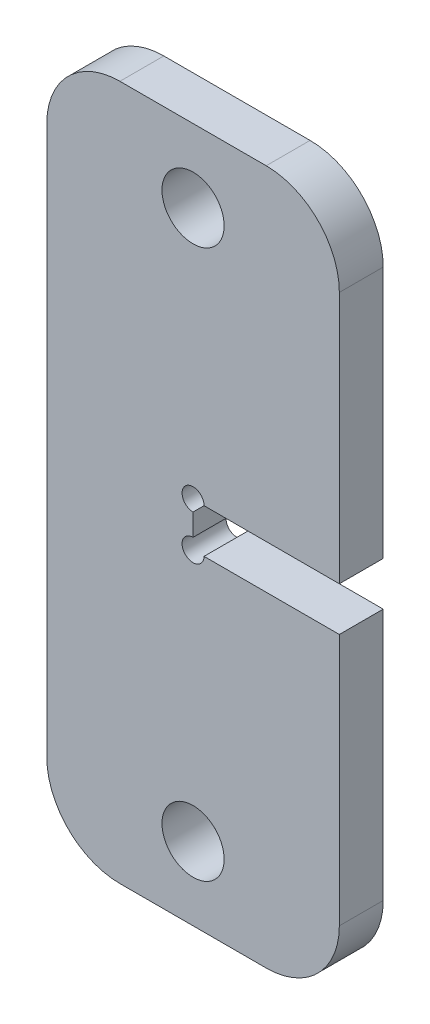
ISO-10303-21;
HEADER;
FILE_DESCRIPTION(('STEP AP214'),'2;1');
FILE_NAME('part.step','',(''),(''),'','','');
FILE_SCHEMA(('AUTOMOTIVE_DESIGN { 1 0 10303 214 1 1 1 1 }'));
ENDSEC;
DATA;
#1=APPLICATION_CONTEXT('core data for automotive mechanical design processes');
#2=APPLICATION_PROTOCOL_DEFINITION('international standard','automotive_design',2000,#1);
#3=PRODUCT_CONTEXT('',#1,'mechanical');
#4=PRODUCT('Part','Part','',(#3));
#5=PRODUCT_RELATED_PRODUCT_CATEGORY('part','',(#4));
#6=PRODUCT_DEFINITION_FORMATION('','',#4);
#7=PRODUCT_DEFINITION_CONTEXT('part definition',#1,'design');
#8=PRODUCT_DEFINITION('design','',#6,#7);
#9=PRODUCT_DEFINITION_SHAPE('','',#8);
#10=(LENGTH_UNIT() NAMED_UNIT(*) SI_UNIT(.MILLI.,.METRE.));
#11=(NAMED_UNIT(*) PLANE_ANGLE_UNIT() SI_UNIT($,.RADIAN.));
#12=(NAMED_UNIT(*) SI_UNIT($,.STERADIAN.) SOLID_ANGLE_UNIT());
#13=UNCERTAINTY_MEASURE_WITH_UNIT(LENGTH_MEASURE(1.E-05),#10,'distance_accuracy_value','');
#14=(GEOMETRIC_REPRESENTATION_CONTEXT(3) GLOBAL_UNCERTAINTY_ASSIGNED_CONTEXT((#13)) GLOBAL_UNIT_ASSIGNED_CONTEXT((#10,
#11,#12)) REPRESENTATION_CONTEXT('',''));
#15=CARTESIAN_POINT('',(0.,0.,0.));
#16=DIRECTION('',(0.,0.,1.));
#17=DIRECTION('',(1.,0.,0.));
#18=AXIS2_PLACEMENT_3D('',#15,#16,#17);
#19=CARTESIAN_POINT('',(681.,310.,6.00000000000001));
#20=DIRECTION('',(0.,0.,1.));
#21=DIRECTION('',(1.,0.,0.));
#22=AXIS2_PLACEMENT_3D('',#19,#20,#21);
#23=PLANE('',#22);
#24=CARTESIAN_POINT('',(691.,385.,6.00000000000001));
#25=DIRECTION('',(0.,0.,-1.));
#26=DIRECTION('',(-1.,0.,0.));
#27=AXIS2_PLACEMENT_3D('',#24,#25,#26);
#28=CIRCLE('',#27,4.24999999999998);
#29=CARTESIAN_POINT('',(686.75,385.,6.00000000000001));
#30=VERTEX_POINT('',#29);
#31=EDGE_CURVE('E195',#30,#30,#28,.T.);
#32=ORIENTED_EDGE('',*,*,#31,.T.);
#33=EDGE_LOOP('',(#32));
#34=FACE_BOUND('',#33,.T.);
#35=CARTESIAN_POINT('',(691.,310.,6.00000000000001));
#36=DIRECTION('',(0.,0.,-1.));
#37=DIRECTION('',(-1.,0.,0.));
#38=AXIS2_PLACEMENT_3D('',#35,#36,#37);
#39=CIRCLE('',#38,4.24999999999998);
#40=CARTESIAN_POINT('',(686.75,310.,6.00000000000001));
#41=VERTEX_POINT('',#40);
#42=EDGE_CURVE('E136',#41,#41,#39,.T.);
#43=ORIENTED_EDGE('',*,*,#42,.T.);
#44=EDGE_LOOP('',(#43));
#45=FACE_BOUND('',#44,.T.);
#46=CARTESIAN_POINT('',(691.,344.5,6.00000000000001));
#47=DIRECTION('',(0.,0.,1.));
#48=DIRECTION('',(1.,0.,0.));
#49=AXIS2_PLACEMENT_3D('',#46,#47,#48);
#50=CIRCLE('',#49,1.49999999999995);
#51=CARTESIAN_POINT('',(692.5,344.5,6.00000000000001));
#52=VERTEX_POINT('',#51);
#53=CARTESIAN_POINT('',(691.,346.,6.00000000000001));
#54=VERTEX_POINT('',#53);
#55=EDGE_CURVE('E203',#52,#54,#50,.F.);
#56=ORIENTED_EDGE('',*,*,#55,.T.);
#57=DIRECTION('',(0.,1.,0.));
#58=VECTOR('',#57,1.);
#59=CARTESIAN_POINT('',(691.,350.5,6.00000000000001));
#60=LINE('',#59,#58);
#61=CARTESIAN_POINT('',(691.,349.,6.00000000000001));
#62=VERTEX_POINT('',#61);
#63=EDGE_CURVE('E141',#54,#62,#60,.T.);
#64=ORIENTED_EDGE('',*,*,#63,.T.);
#65=CARTESIAN_POINT('',(691.,350.5,6.00000000000001));
#66=DIRECTION('',(0.,0.,1.));
#67=DIRECTION('',(1.,0.,0.));
#68=AXIS2_PLACEMENT_3D('',#65,#66,#67);
#69=CIRCLE('',#68,1.49999999999995);
#70=CARTESIAN_POINT('',(692.5,350.5,6.00000000000001));
#71=VERTEX_POINT('',#70);
#72=EDGE_CURVE('E200',#62,#71,#69,.F.);
#73=ORIENTED_EDGE('',*,*,#72,.T.);
#74=DIRECTION('',(1.,0.,0.));
#75=VECTOR('',#74,1.);
#76=CARTESIAN_POINT('',(691.,350.5,6.00000000000001));
#77=LINE('',#76,#75);
#78=CARTESIAN_POINT('',(711.,350.5,6.00000000000001));
#79=VERTEX_POINT('',#78);
#80=EDGE_CURVE('E121',#71,#79,#77,.T.);
#81=ORIENTED_EDGE('',*,*,#80,.T.);
#82=DIRECTION('',(0.,1.,0.));
#83=VECTOR('',#82,1.);
#84=CARTESIAN_POINT('',(711.,350.5,6.00000000000001));
#85=LINE('',#84,#83);
#86=CARTESIAN_POINT('',(711.,385.,6.00000000000001));
#87=VERTEX_POINT('',#86);
#88=EDGE_CURVE('E118',#79,#87,#85,.T.);
#89=ORIENTED_EDGE('',*,*,#88,.T.);
#90=CARTESIAN_POINT('',(701.,385.,6.00000000000001));
#91=DIRECTION('',(0.,0.,-1.));
#92=DIRECTION('',(-1.,0.,0.));
#93=AXIS2_PLACEMENT_3D('',#90,#91,#92);
#94=CIRCLE('',#93,10.);
#95=CARTESIAN_POINT('',(701.,395.,6.00000000000001));
#96=VERTEX_POINT('',#95);
#97=EDGE_CURVE('E19',#96,#87,#94,.T.);
#98=ORIENTED_EDGE('',*,*,#97,.F.);
#99=DIRECTION('',(1.,0.,0.));
#100=VECTOR('',#99,1.);
#101=CARTESIAN_POINT('',(701.,395.,6.00000000000001));
#102=LINE('',#101,#100);
#103=CARTESIAN_POINT('',(681.,395.,6.00000000000001));
#104=VERTEX_POINT('',#103);
#105=EDGE_CURVE('E131',#96,#104,#102,.F.);
#106=ORIENTED_EDGE('',*,*,#105,.T.);
#107=CARTESIAN_POINT('',(681.,385.,6.00000000000001));
#108=DIRECTION('',(0.,0.,-1.));
#109=DIRECTION('',(-1.,0.,0.));
#110=AXIS2_PLACEMENT_3D('',#107,#108,#109);
#111=CIRCLE('',#110,10.);
#112=CARTESIAN_POINT('',(671.,385.,6.00000000000001));
#113=VERTEX_POINT('',#112);
#114=EDGE_CURVE('E167',#113,#104,#111,.T.);
#115=ORIENTED_EDGE('',*,*,#114,.F.);
#116=DIRECTION('',(0.,1.,0.));
#117=VECTOR('',#116,1.);
#118=CARTESIAN_POINT('',(671.,385.,6.00000000000001));
#119=LINE('',#118,#117);
#120=CARTESIAN_POINT('',(671.,310.,6.00000000000001));
#121=VERTEX_POINT('',#120);
#122=EDGE_CURVE('E162',#113,#121,#119,.F.);
#123=ORIENTED_EDGE('',*,*,#122,.T.);
#124=CARTESIAN_POINT('',(681.,310.,6.00000000000001));
#125=DIRECTION('',(0.,0.,-1.));
#126=DIRECTION('',(-1.,0.,0.));
#127=AXIS2_PLACEMENT_3D('',#124,#125,#126);
#128=CIRCLE('',#127,10.);
#129=CARTESIAN_POINT('',(681.,300.,6.00000000000001));
#130=VERTEX_POINT('',#129);
#131=EDGE_CURVE('E165',#130,#121,#128,.T.);
#132=ORIENTED_EDGE('',*,*,#131,.F.);
#133=DIRECTION('',(1.,0.,0.));
#134=VECTOR('',#133,1.);
#135=CARTESIAN_POINT('',(681.,300.,6.00000000000001));
#136=LINE('',#135,#134);
#137=CARTESIAN_POINT('',(701.,300.,6.00000000000001));
#138=VERTEX_POINT('',#137);
#139=EDGE_CURVE('E157',#130,#138,#136,.T.);
#140=ORIENTED_EDGE('',*,*,#139,.T.);
#141=CARTESIAN_POINT('',(701.,310.,6.00000000000001));
#142=DIRECTION('',(0.,0.,-1.));
#143=DIRECTION('',(-1.,0.,0.));
#144=AXIS2_PLACEMENT_3D('',#141,#142,#143);
#145=CIRCLE('',#144,10.);
#146=CARTESIAN_POINT('',(711.,310.,6.00000000000001));
#147=VERTEX_POINT('',#146);
#148=EDGE_CURVE('E160',#147,#138,#145,.T.);
#149=ORIENTED_EDGE('',*,*,#148,.F.);
#150=DIRECTION('',(0.,1.,0.));
#151=VECTOR('',#150,1.);
#152=CARTESIAN_POINT('',(711.,310.,6.00000000000001));
#153=LINE('',#152,#151);
#154=CARTESIAN_POINT('',(711.,344.5,6.00000000000001));
#155=VERTEX_POINT('',#154);
#156=EDGE_CURVE('E151',#147,#155,#153,.T.);
#157=ORIENTED_EDGE('',*,*,#156,.T.);
#158=DIRECTION('',(1.,0.,0.));
#159=VECTOR('',#158,1.);
#160=CARTESIAN_POINT('',(691.,344.5,6.00000000000001));
#161=LINE('',#160,#159);
#162=EDGE_CURVE('E145',#155,#52,#161,.F.);
#163=ORIENTED_EDGE('',*,*,#162,.T.);
#164=EDGE_LOOP('',(#56,#64,#73,#81,#89,#98,#106,#115,#123,#132,#140,#149,#157,#163));
#165=FACE_BOUND('',#164,.T.);
#166=ADVANCED_FACE('F16',(#34,#45,#165),#23,.T.);
#167=CARTESIAN_POINT('',(711.,350.5,6.00000000000001));
#168=DIRECTION('',(-1.,0.,0.));
#169=DIRECTION('',(0.,0.,1.));
#170=AXIS2_PLACEMENT_3D('',#167,#168,#169);
#171=PLANE('',#170);
#172=DIRECTION('',(0.,0.,-1.));
#173=VECTOR('',#172,1.);
#174=CARTESIAN_POINT('',(711.,385.,6.00000000000001));
#175=LINE('',#174,#173);
#176=CARTESIAN_POINT('',(711.,385.,0.));
#177=VERTEX_POINT('',#176);
#178=EDGE_CURVE('E115',#87,#177,#175,.T.);
#179=ORIENTED_EDGE('',*,*,#178,.F.);
#180=ORIENTED_EDGE('',*,*,#88,.F.);
#181=DIRECTION('',(0.,0.,1.));
#182=VECTOR('',#181,1.);
#183=CARTESIAN_POINT('',(711.,350.5,6.00000000000001));
#184=LINE('',#183,#182);
#185=CARTESIAN_POINT('',(711.,350.5,0.));
#186=VERTEX_POINT('',#185);
#187=EDGE_CURVE('E202',#79,#186,#184,.F.);
#188=ORIENTED_EDGE('',*,*,#187,.T.);
#189=DIRECTION('',(0.,1.,0.));
#190=VECTOR('',#189,1.);
#191=CARTESIAN_POINT('',(711.,310.,0.));
#192=LINE('',#191,#190);
#193=EDGE_CURVE('E129',#186,#177,#192,.T.);
#194=ORIENTED_EDGE('',*,*,#193,.T.);
#195=EDGE_LOOP('',(#179,#180,#188,#194));
#196=FACE_BOUND('',#195,.T.);
#197=ADVANCED_FACE('F127',(#196),#171,.F.);
#198=CARTESIAN_POINT('',(701.,385.,6.00000000000001));
#199=DIRECTION('',(0.,0.,-1.));
#200=DIRECTION('',(-1.,0.,0.));
#201=AXIS2_PLACEMENT_3D('',#198,#199,#200);
#202=CYLINDRICAL_SURFACE('',#201,10.);
#203=ORIENTED_EDGE('',*,*,#97,.T.);
#204=ORIENTED_EDGE('',*,*,#178,.T.);
#205=CARTESIAN_POINT('',(701.,385.,0.));
#206=DIRECTION('',(0.,0.,-1.));
#207=DIRECTION('',(-1.,0.,0.));
#208=AXIS2_PLACEMENT_3D('',#205,#206,#207);
#209=CIRCLE('',#208,10.);
#210=CARTESIAN_POINT('',(701.,395.,0.));
#211=VERTEX_POINT('',#210);
#212=EDGE_CURVE('E193',#177,#211,#209,.F.);
#213=ORIENTED_EDGE('',*,*,#212,.T.);
#214=DIRECTION('',(0.,0.,-1.));
#215=VECTOR('',#214,1.);
#216=CARTESIAN_POINT('',(701.,395.,6.00000000000001));
#217=LINE('',#216,#215);
#218=EDGE_CURVE('E117',#211,#96,#217,.F.);
#219=ORIENTED_EDGE('',*,*,#218,.T.);
#220=EDGE_LOOP('',(#203,#204,#213,#219));
#221=FACE_BOUND('',#220,.T.);
#222=ADVANCED_FACE('F112',(#221),#202,.T.);
#223=CARTESIAN_POINT('',(701.,395.,6.00000000000001));
#224=DIRECTION('',(0.,-1.,0.));
#225=DIRECTION('',(0.,0.,-1.));
#226=AXIS2_PLACEMENT_3D('',#223,#224,#225);
#227=PLANE('',#226);
#228=DIRECTION('',(0.,0.,-1.));
#229=VECTOR('',#228,1.);
#230=CARTESIAN_POINT('',(681.,395.,6.00000000000001));
#231=LINE('',#230,#229);
#232=CARTESIAN_POINT('',(681.,395.,0.));
#233=VERTEX_POINT('',#232);
#234=EDGE_CURVE('E208',#104,#233,#231,.T.);
#235=ORIENTED_EDGE('',*,*,#234,.F.);
#236=ORIENTED_EDGE('',*,*,#105,.F.);
#237=ORIENTED_EDGE('',*,*,#218,.F.);
#238=DIRECTION('',(1.,0.,0.));
#239=VECTOR('',#238,1.);
#240=CARTESIAN_POINT('',(681.,395.,0.));
#241=LINE('',#240,#239);
#242=EDGE_CURVE('E192',#211,#233,#241,.F.);
#243=ORIENTED_EDGE('',*,*,#242,.T.);
#244=EDGE_LOOP('',(#235,#236,#237,#243));
#245=FACE_BOUND('',#244,.T.);
#246=ADVANCED_FACE('F301',(#245),#227,.F.);
#247=CARTESIAN_POINT('',(681.,385.,6.00000000000001));
#248=DIRECTION('',(0.,0.,-1.));
#249=DIRECTION('',(-1.,0.,0.));
#250=AXIS2_PLACEMENT_3D('',#247,#248,#249);
#251=CYLINDRICAL_SURFACE('',#250,10.);
#252=ORIENTED_EDGE('',*,*,#114,.T.);
#253=ORIENTED_EDGE('',*,*,#234,.T.);
#254=CARTESIAN_POINT('',(681.,385.,0.));
#255=DIRECTION('',(0.,0.,-1.));
#256=DIRECTION('',(-1.,0.,0.));
#257=AXIS2_PLACEMENT_3D('',#254,#255,#256);
#258=CIRCLE('',#257,10.);
#259=CARTESIAN_POINT('',(671.,385.,0.));
#260=VERTEX_POINT('',#259);
#261=EDGE_CURVE('E189',#233,#260,#258,.F.);
#262=ORIENTED_EDGE('',*,*,#261,.T.);
#263=DIRECTION('',(0.,0.,-1.));
#264=VECTOR('',#263,1.);
#265=CARTESIAN_POINT('',(671.,385.,6.00000000000001));
#266=LINE('',#265,#264);
#267=EDGE_CURVE('E166',#260,#113,#266,.F.);
#268=ORIENTED_EDGE('',*,*,#267,.T.);
#269=EDGE_LOOP('',(#252,#253,#262,#268));
#270=FACE_BOUND('',#269,.T.);
#271=ADVANCED_FACE('F298',(#270),#251,.T.);
#272=CARTESIAN_POINT('',(671.,385.,6.00000000000001));
#273=DIRECTION('',(1.,0.,0.));
#274=DIRECTION('',(0.,0.,-1.));
#275=AXIS2_PLACEMENT_3D('',#272,#273,#274);
#276=PLANE('',#275);
#277=DIRECTION('',(0.,0.,-1.));
#278=VECTOR('',#277,1.);
#279=CARTESIAN_POINT('',(671.,310.,6.00000000000001));
#280=LINE('',#279,#278);
#281=CARTESIAN_POINT('',(671.,310.,0.));
#282=VERTEX_POINT('',#281);
#283=EDGE_CURVE('E207',#121,#282,#280,.T.);
#284=ORIENTED_EDGE('',*,*,#283,.F.);
#285=ORIENTED_EDGE('',*,*,#122,.F.);
#286=ORIENTED_EDGE('',*,*,#267,.F.);
#287=DIRECTION('',(0.,1.,0.));
#288=VECTOR('',#287,1.);
#289=CARTESIAN_POINT('',(671.,310.,0.));
#290=LINE('',#289,#288);
#291=EDGE_CURVE('E188',#260,#282,#290,.F.);
#292=ORIENTED_EDGE('',*,*,#291,.T.);
#293=EDGE_LOOP('',(#284,#285,#286,#292));
#294=FACE_BOUND('',#293,.T.);
#295=ADVANCED_FACE('F296',(#294),#276,.F.);
#296=CARTESIAN_POINT('',(681.,310.,6.00000000000001));
#297=DIRECTION('',(0.,0.,-1.));
#298=DIRECTION('',(-1.,0.,0.));
#299=AXIS2_PLACEMENT_3D('',#296,#297,#298);
#300=CYLINDRICAL_SURFACE('',#299,10.);
#301=ORIENTED_EDGE('',*,*,#131,.T.);
#302=ORIENTED_EDGE('',*,*,#283,.T.);
#303=CARTESIAN_POINT('',(681.,310.,0.));
#304=DIRECTION('',(0.,0.,-1.));
#305=DIRECTION('',(-1.,0.,0.));
#306=AXIS2_PLACEMENT_3D('',#303,#304,#305);
#307=CIRCLE('',#306,10.);
#308=CARTESIAN_POINT('',(681.,300.,0.));
#309=VERTEX_POINT('',#308);
#310=EDGE_CURVE('E185',#282,#309,#307,.F.);
#311=ORIENTED_EDGE('',*,*,#310,.T.);
#312=DIRECTION('',(0.,0.,1.));
#313=VECTOR('',#312,1.);
#314=CARTESIAN_POINT('',(681.,300.,6.00000000000001));
#315=LINE('',#314,#313);
#316=EDGE_CURVE('E161',#309,#130,#315,.T.);
#317=ORIENTED_EDGE('',*,*,#316,.T.);
#318=EDGE_LOOP('',(#301,#302,#311,#317));
#319=FACE_BOUND('',#318,.T.);
#320=ADVANCED_FACE('F292',(#319),#300,.T.);
#321=CARTESIAN_POINT('',(681.,300.,6.00000000000001));
#322=DIRECTION('',(0.,1.,0.));
#323=DIRECTION('',(0.,0.,1.));
#324=AXIS2_PLACEMENT_3D('',#321,#322,#323);
#325=PLANE('',#324);
#326=DIRECTION('',(0.,0.,-1.));
#327=VECTOR('',#326,1.);
#328=CARTESIAN_POINT('',(701.,300.,6.00000000000001));
#329=LINE('',#328,#327);
#330=CARTESIAN_POINT('',(701.,300.,0.));
#331=VERTEX_POINT('',#330);
#332=EDGE_CURVE('E206',#138,#331,#329,.T.);
#333=ORIENTED_EDGE('',*,*,#332,.F.);
#334=ORIENTED_EDGE('',*,*,#139,.F.);
#335=ORIENTED_EDGE('',*,*,#316,.F.);
#336=DIRECTION('',(1.,0.,0.));
#337=VECTOR('',#336,1.);
#338=CARTESIAN_POINT('',(681.,300.,0.));
#339=LINE('',#338,#337);
#340=EDGE_CURVE('E184',#309,#331,#339,.T.);
#341=ORIENTED_EDGE('',*,*,#340,.T.);
#342=EDGE_LOOP('',(#333,#334,#335,#341));
#343=FACE_BOUND('',#342,.T.);
#344=ADVANCED_FACE('F289',(#343),#325,.F.);
#345=CARTESIAN_POINT('',(701.,310.,6.00000000000001));
#346=DIRECTION('',(0.,0.,-1.));
#347=DIRECTION('',(-1.,0.,0.));
#348=AXIS2_PLACEMENT_3D('',#345,#346,#347);
#349=CYLINDRICAL_SURFACE('',#348,10.);
#350=ORIENTED_EDGE('',*,*,#148,.T.);
#351=ORIENTED_EDGE('',*,*,#332,.T.);
#352=CARTESIAN_POINT('',(701.,310.,0.));
#353=DIRECTION('',(0.,0.,-1.));
#354=DIRECTION('',(-1.,0.,0.));
#355=AXIS2_PLACEMENT_3D('',#352,#353,#354);
#356=CIRCLE('',#355,10.);
#357=CARTESIAN_POINT('',(711.,310.,0.));
#358=VERTEX_POINT('',#357);
#359=EDGE_CURVE('E180',#331,#358,#356,.F.);
#360=ORIENTED_EDGE('',*,*,#359,.T.);
#361=DIRECTION('',(0.,0.,1.));
#362=VECTOR('',#361,1.);
#363=CARTESIAN_POINT('',(711.,310.,6.00000000000001));
#364=LINE('',#363,#362);
#365=EDGE_CURVE('E154',#358,#147,#364,.T.);
#366=ORIENTED_EDGE('',*,*,#365,.T.);
#367=EDGE_LOOP('',(#350,#351,#360,#366));
#368=FACE_BOUND('',#367,.T.);
#369=ADVANCED_FACE('F284',(#368),#349,.T.);
#370=CARTESIAN_POINT('',(711.,310.,6.00000000000001));
#371=DIRECTION('',(-1.,0.,0.));
#372=DIRECTION('',(0.,0.,1.));
#373=AXIS2_PLACEMENT_3D('',#370,#371,#372);
#374=PLANE('',#373);
#375=DIRECTION('',(0.,0.,-1.));
#376=VECTOR('',#375,1.);
#377=CARTESIAN_POINT('',(711.,344.5,6.00000000000001));
#378=LINE('',#377,#376);
#379=CARTESIAN_POINT('',(711.,344.5,0.));
#380=VERTEX_POINT('',#379);
#381=EDGE_CURVE('E148',#380,#155,#378,.F.);
#382=ORIENTED_EDGE('',*,*,#381,.T.);
#383=ORIENTED_EDGE('',*,*,#156,.F.);
#384=ORIENTED_EDGE('',*,*,#365,.F.);
#385=DIRECTION('',(0.,1.,0.));
#386=VECTOR('',#385,1.);
#387=CARTESIAN_POINT('',(711.,310.,0.));
#388=LINE('',#387,#386);
#389=EDGE_CURVE('E183',#358,#380,#388,.T.);
#390=ORIENTED_EDGE('',*,*,#389,.T.);
#391=EDGE_LOOP('',(#382,#383,#384,#390));
#392=FACE_BOUND('',#391,.T.);
#393=ADVANCED_FACE('F281',(#392),#374,.F.);
#394=CARTESIAN_POINT('',(691.,344.5,6.00000000000001));
#395=DIRECTION('',(0.,-1.,0.));
#396=DIRECTION('',(0.,0.,-1.));
#397=AXIS2_PLACEMENT_3D('',#394,#395,#396);
#398=PLANE('',#397);
#399=DIRECTION('',(0.,0.,1.));
#400=VECTOR('',#399,1.);
#401=CARTESIAN_POINT('',(692.5,344.5,0.));
#402=LINE('',#401,#400);
#403=CARTESIAN_POINT('',(692.5,344.5,0.));
#404=VERTEX_POINT('',#403);
#405=EDGE_CURVE('E147',#404,#52,#402,.T.);
#406=ORIENTED_EDGE('',*,*,#405,.T.);
#407=ORIENTED_EDGE('',*,*,#162,.F.);
#408=ORIENTED_EDGE('',*,*,#381,.F.);
#409=DIRECTION('',(1.,0.,0.));
#410=VECTOR('',#409,1.);
#411=CARTESIAN_POINT('',(681.,344.5,0.));
#412=LINE('',#411,#410);
#413=EDGE_CURVE('E179',#380,#404,#412,.F.);
#414=ORIENTED_EDGE('',*,*,#413,.T.);
#415=EDGE_LOOP('',(#406,#407,#408,#414));
#416=FACE_BOUND('',#415,.T.);
#417=ADVANCED_FACE('F275',(#416),#398,.F.);
#418=CARTESIAN_POINT('',(691.,344.5,0.));
#419=DIRECTION('',(0.,0.,1.));
#420=DIRECTION('',(1.,0.,0.));
#421=AXIS2_PLACEMENT_3D('',#418,#419,#420);
#422=CYLINDRICAL_SURFACE('',#421,1.49999999999995);
#423=DIRECTION('',(0.,0.,1.));
#424=VECTOR('',#423,1.);
#425=CARTESIAN_POINT('',(691.,346.,6.00000000000001));
#426=LINE('',#425,#424);
#427=CARTESIAN_POINT('',(691.,346.,0.));
#428=VERTEX_POINT('',#427);
#429=EDGE_CURVE('E144',#428,#54,#426,.T.);
#430=ORIENTED_EDGE('',*,*,#429,.T.);
#431=ORIENTED_EDGE('',*,*,#55,.F.);
#432=ORIENTED_EDGE('',*,*,#405,.F.);
#433=CARTESIAN_POINT('',(691.,344.5,0.));
#434=DIRECTION('',(0.,0.,1.));
#435=DIRECTION('',(1.,0.,0.));
#436=AXIS2_PLACEMENT_3D('',#433,#434,#435);
#437=CIRCLE('',#436,1.49999999999995);
#438=EDGE_CURVE('E176',#404,#428,#437,.F.);
#439=ORIENTED_EDGE('',*,*,#438,.T.);
#440=EDGE_LOOP('',(#430,#431,#432,#439));
#441=FACE_BOUND('',#440,.T.);
#442=ADVANCED_FACE('F271',(#441),#422,.F.);
#443=CARTESIAN_POINT('',(691.,350.5,6.00000000000001));
#444=DIRECTION('',(-1.,0.,0.));
#445=DIRECTION('',(0.,0.,1.));
#446=AXIS2_PLACEMENT_3D('',#443,#444,#445);
#447=PLANE('',#446);
#448=DIRECTION('',(0.,0.,1.));
#449=VECTOR('',#448,1.);
#450=CARTESIAN_POINT('',(691.,349.,0.));
#451=LINE('',#450,#449);
#452=CARTESIAN_POINT('',(691.,349.,0.));
#453=VERTEX_POINT('',#452);
#454=EDGE_CURVE('E143',#453,#62,#451,.T.);
#455=ORIENTED_EDGE('',*,*,#454,.T.);
#456=ORIENTED_EDGE('',*,*,#63,.F.);
#457=ORIENTED_EDGE('',*,*,#429,.F.);
#458=DIRECTION('',(0.,1.,0.));
#459=VECTOR('',#458,1.);
#460=CARTESIAN_POINT('',(691.,310.,0.));
#461=LINE('',#460,#459);
#462=EDGE_CURVE('E175',#428,#453,#461,.T.);
#463=ORIENTED_EDGE('',*,*,#462,.T.);
#464=EDGE_LOOP('',(#455,#456,#457,#463));
#465=FACE_BOUND('',#464,.T.);
#466=ADVANCED_FACE('F267',(#465),#447,.F.);
#467=CARTESIAN_POINT('',(691.,350.5,0.));
#468=DIRECTION('',(0.,0.,1.));
#469=DIRECTION('',(1.,0.,0.));
#470=AXIS2_PLACEMENT_3D('',#467,#468,#469);
#471=CYLINDRICAL_SURFACE('',#470,1.49999999999995);
#472=DIRECTION('',(0.,0.,1.));
#473=VECTOR('',#472,1.);
#474=CARTESIAN_POINT('',(692.5,350.5,6.00000000000001));
#475=LINE('',#474,#473);
#476=CARTESIAN_POINT('',(692.5,350.5,0.));
#477=VERTEX_POINT('',#476);
#478=EDGE_CURVE('E34',#477,#71,#475,.T.);
#479=ORIENTED_EDGE('',*,*,#478,.T.);
#480=ORIENTED_EDGE('',*,*,#72,.F.);
#481=ORIENTED_EDGE('',*,*,#454,.F.);
#482=CARTESIAN_POINT('',(691.,350.5,0.));
#483=DIRECTION('',(0.,0.,1.));
#484=DIRECTION('',(1.,0.,0.));
#485=AXIS2_PLACEMENT_3D('',#482,#483,#484);
#486=CIRCLE('',#485,1.49999999999995);
#487=EDGE_CURVE('E172',#453,#477,#486,.F.);
#488=ORIENTED_EDGE('',*,*,#487,.T.);
#489=EDGE_LOOP('',(#479,#480,#481,#488));
#490=FACE_BOUND('',#489,.T.);
#491=ADVANCED_FACE('F263',(#490),#471,.F.);
#492=CARTESIAN_POINT('',(691.,350.5,6.00000000000001));
#493=DIRECTION('',(0.,1.,0.));
#494=DIRECTION('',(0.,0.,1.));
#495=AXIS2_PLACEMENT_3D('',#492,#493,#494);
#496=PLANE('',#495);
#497=ORIENTED_EDGE('',*,*,#478,.F.);
#498=DIRECTION('',(1.,0.,0.));
#499=VECTOR('',#498,1.);
#500=CARTESIAN_POINT('',(681.,350.5,0.));
#501=LINE('',#500,#499);
#502=EDGE_CURVE('E171',#477,#186,#501,.T.);
#503=ORIENTED_EDGE('',*,*,#502,.T.);
#504=ORIENTED_EDGE('',*,*,#187,.F.);
#505=ORIENTED_EDGE('',*,*,#80,.F.);
#506=EDGE_LOOP('',(#497,#503,#504,#505));
#507=FACE_BOUND('',#506,.T.);
#508=ADVANCED_FACE('F256',(#507),#496,.F.);
#509=CARTESIAN_POINT('',(691.,310.,6.00000000000001));
#510=DIRECTION('',(0.,0.,-1.));
#511=DIRECTION('',(-1.,0.,0.));
#512=AXIS2_PLACEMENT_3D('',#509,#510,#511);
#513=CYLINDRICAL_SURFACE('',#512,4.24999999999998);
#514=CARTESIAN_POINT('',(691.,310.,0.));
#515=DIRECTION('',(0.,0.,-1.));
#516=DIRECTION('',(-1.,0.,0.));
#517=AXIS2_PLACEMENT_3D('',#514,#515,#516);
#518=CIRCLE('',#517,4.24999999999998);
#519=CARTESIAN_POINT('',(686.75,310.,0.));
#520=VERTEX_POINT('',#519);
#521=EDGE_CURVE('E25',#520,#520,#518,.T.);
#522=ORIENTED_EDGE('',*,*,#521,.T.);
#523=EDGE_LOOP('',(#522));
#524=FACE_BOUND('',#523,.T.);
#525=ORIENTED_EDGE('',*,*,#42,.F.);
#526=EDGE_LOOP('',(#525));
#527=FACE_BOUND('',#526,.T.);
#528=ADVANCED_FACE('F319',(#524,#527),#513,.F.);
#529=CARTESIAN_POINT('',(691.,385.,6.00000000000001));
#530=DIRECTION('',(0.,0.,-1.));
#531=DIRECTION('',(-1.,0.,0.));
#532=AXIS2_PLACEMENT_3D('',#529,#530,#531);
#533=CYLINDRICAL_SURFACE('',#532,4.24999999999998);
#534=CARTESIAN_POINT('',(691.,385.,0.));
#535=DIRECTION('',(0.,0.,-1.));
#536=DIRECTION('',(-1.,0.,0.));
#537=AXIS2_PLACEMENT_3D('',#534,#535,#536);
#538=CIRCLE('',#537,4.24999999999998);
#539=CARTESIAN_POINT('',(686.75,385.,0.));
#540=VERTEX_POINT('',#539);
#541=EDGE_CURVE('E11',#540,#540,#538,.T.);
#542=ORIENTED_EDGE('',*,*,#541,.T.);
#543=EDGE_LOOP('',(#542));
#544=FACE_BOUND('',#543,.T.);
#545=ORIENTED_EDGE('',*,*,#31,.F.);
#546=EDGE_LOOP('',(#545));
#547=FACE_BOUND('',#546,.T.);
#548=ADVANCED_FACE('F313',(#544,#547),#533,.F.);
#549=CARTESIAN_POINT('',(681.,310.,0.));
#550=DIRECTION('',(0.,0.,1.));
#551=DIRECTION('',(1.,0.,0.));
#552=AXIS2_PLACEMENT_3D('',#549,#550,#551);
#553=PLANE('',#552);
#554=ORIENTED_EDGE('',*,*,#541,.F.);
#555=EDGE_LOOP('',(#554));
#556=FACE_BOUND('',#555,.T.);
#557=ORIENTED_EDGE('',*,*,#521,.F.);
#558=EDGE_LOOP('',(#557));
#559=FACE_BOUND('',#558,.T.);
#560=ORIENTED_EDGE('',*,*,#487,.F.);
#561=ORIENTED_EDGE('',*,*,#462,.F.);
#562=ORIENTED_EDGE('',*,*,#438,.F.);
#563=ORIENTED_EDGE('',*,*,#413,.F.);
#564=ORIENTED_EDGE('',*,*,#389,.F.);
#565=ORIENTED_EDGE('',*,*,#359,.F.);
#566=ORIENTED_EDGE('',*,*,#340,.F.);
#567=ORIENTED_EDGE('',*,*,#310,.F.);
#568=ORIENTED_EDGE('',*,*,#291,.F.);
#569=ORIENTED_EDGE('',*,*,#261,.F.);
#570=ORIENTED_EDGE('',*,*,#242,.F.);
#571=ORIENTED_EDGE('',*,*,#212,.F.);
#572=ORIENTED_EDGE('',*,*,#193,.F.);
#573=ORIENTED_EDGE('',*,*,#502,.F.);
#574=EDGE_LOOP('',(#560,#561,#562,#563,#564,#565,#566,#567,#568,#569,#570,#571,#572,#573));
#575=FACE_BOUND('',#574,.T.);
#576=ADVANCED_FACE('F260',(#556,#559,#575),#553,.F.);
#577=CLOSED_SHELL('',(#166,#197,#222,#246,#271,#295,#320,#344,#369,#393,#417,#442,#466,#491,
#508,#528,#548,#576));
#578=MANIFOLD_SOLID_BREP('B1',#577);
#579=ADVANCED_BREP_SHAPE_REPRESENTATION('',(#18,#578),#14);
#580=SHAPE_DEFINITION_REPRESENTATION(#9,#579);
ENDSEC;
END-ISO-10303-21;
